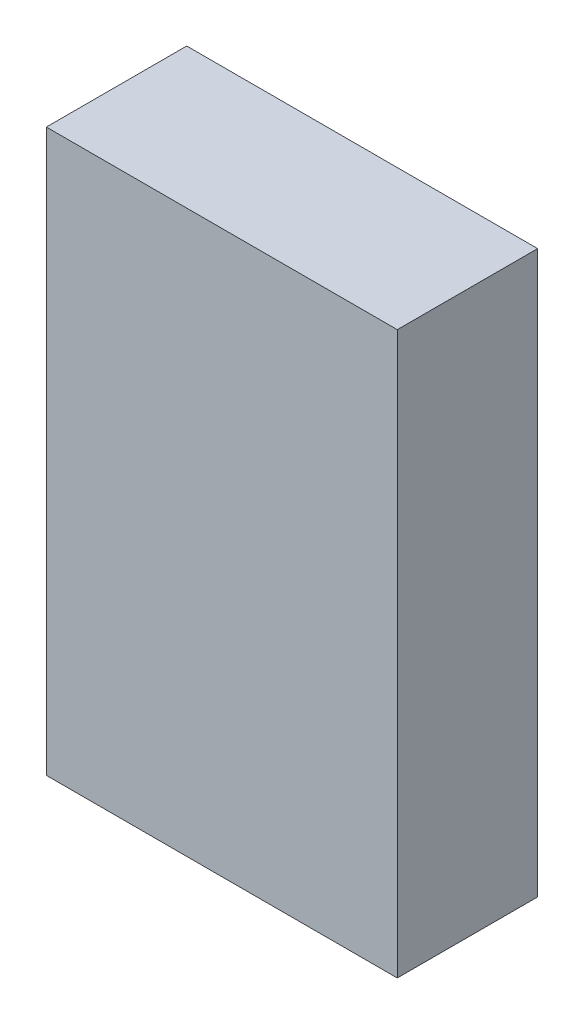
ISO-10303-21;
HEADER;
FILE_DESCRIPTION(('STEP AP214'),'2;1');
FILE_NAME('part.step','',(''),(''),'','','');
FILE_SCHEMA(('AUTOMOTIVE_DESIGN { 1 0 10303 214 1 1 1 1 }'));
ENDSEC;
DATA;
#1=APPLICATION_CONTEXT('core data for automotive mechanical design processes');
#2=APPLICATION_PROTOCOL_DEFINITION('international standard','automotive_design',2000,#1);
#3=PRODUCT_CONTEXT('',#1,'mechanical');
#4=PRODUCT('Part','Part','',(#3));
#5=PRODUCT_RELATED_PRODUCT_CATEGORY('part','',(#4));
#6=PRODUCT_DEFINITION_FORMATION('','',#4);
#7=PRODUCT_DEFINITION_CONTEXT('part definition',#1,'design');
#8=PRODUCT_DEFINITION('design','',#6,#7);
#9=PRODUCT_DEFINITION_SHAPE('','',#8);
#10=(LENGTH_UNIT() NAMED_UNIT(*) SI_UNIT(.MILLI.,.METRE.));
#11=(NAMED_UNIT(*) PLANE_ANGLE_UNIT() SI_UNIT($,.RADIAN.));
#12=(NAMED_UNIT(*) SI_UNIT($,.STERADIAN.) SOLID_ANGLE_UNIT());
#13=UNCERTAINTY_MEASURE_WITH_UNIT(LENGTH_MEASURE(1.E-05),#10,'distance_accuracy_value','');
#14=(GEOMETRIC_REPRESENTATION_CONTEXT(3) GLOBAL_UNCERTAINTY_ASSIGNED_CONTEXT((#13)) GLOBAL_UNIT_ASSIGNED_CONTEXT((#10,
#11,#12)) REPRESENTATION_CONTEXT('',''));
#15=CARTESIAN_POINT('',(0.,0.,0.));
#16=DIRECTION('',(0.,0.,1.));
#17=DIRECTION('',(1.,0.,0.));
#18=AXIS2_PLACEMENT_3D('',#15,#16,#17);
#19=CARTESIAN_POINT('',(0.,0.,0.499999));
#20=DIRECTION('',(0.,0.,1.));
#21=DIRECTION('',(1.,0.,0.));
#22=AXIS2_PLACEMENT_3D('',#19,#20,#21);
#23=PLANE('',#22);
#24=DIRECTION('',(-1.,0.,0.));
#25=VECTOR('',#24,1.);
#26=CARTESIAN_POINT('',(0.62500002,1.00000054,0.499999));
#27=LINE('',#26,#25);
#28=CARTESIAN_POINT('',(0.62500002,1.00000054,0.499999));
#29=VERTEX_POINT('',#28);
#30=CARTESIAN_POINT('',(-0.62500002,1.00000054,0.499999));
#31=VERTEX_POINT('',#30);
#32=EDGE_CURVE('E90',#29,#31,#27,.T.);
#33=ORIENTED_EDGE('',*,*,#32,.T.);
#34=DIRECTION('',(0.,-1.,0.));
#35=VECTOR('',#34,1.);
#36=CARTESIAN_POINT('',(-0.62500002,1.00000054,0.499999));
#37=LINE('',#36,#35);
#38=CARTESIAN_POINT('',(-0.62500002,-1.00000054,0.499999));
#39=VERTEX_POINT('',#38);
#40=EDGE_CURVE('E88',#31,#39,#37,.T.);
#41=ORIENTED_EDGE('',*,*,#40,.T.);
#42=DIRECTION('',(1.,0.,0.));
#43=VECTOR('',#42,1.);
#44=CARTESIAN_POINT('',(-0.62500002,-1.00000054,0.499999));
#45=LINE('',#44,#43);
#46=CARTESIAN_POINT('',(0.62500002,-1.00000054,0.499999));
#47=VERTEX_POINT('',#46);
#48=EDGE_CURVE('E81',#39,#47,#45,.T.);
#49=ORIENTED_EDGE('',*,*,#48,.T.);
#50=DIRECTION('',(0.,1.,0.));
#51=VECTOR('',#50,1.);
#52=CARTESIAN_POINT('',(0.62500002,-1.00000054,0.499999));
#53=LINE('',#52,#51);
#54=EDGE_CURVE('E11',#47,#29,#53,.T.);
#55=ORIENTED_EDGE('',*,*,#54,.T.);
#56=EDGE_LOOP('',(#33,#41,#49,#55));
#57=FACE_BOUND('',#56,.T.);
#58=ADVANCED_FACE('F16',(#57),#23,.T.);
#59=CARTESIAN_POINT('',(0.,0.,0.));
#60=DIRECTION('',(0.,0.,1.));
#61=DIRECTION('',(1.,0.,0.));
#62=AXIS2_PLACEMENT_3D('',#59,#60,#61);
#63=PLANE('',#62);
#64=DIRECTION('',(0.,1.,0.));
#65=VECTOR('',#64,1.);
#66=CARTESIAN_POINT('',(0.62500002,-1.00000054,0.));
#67=LINE('',#66,#65);
#68=CARTESIAN_POINT('',(0.62500002,-1.00000054,0.));
#69=VERTEX_POINT('',#68);
#70=CARTESIAN_POINT('',(0.62500002,1.00000054,0.));
#71=VERTEX_POINT('',#70);
#72=EDGE_CURVE('E27',#69,#71,#67,.T.);
#73=ORIENTED_EDGE('',*,*,#72,.F.);
#74=DIRECTION('',(1.,0.,0.));
#75=VECTOR('',#74,1.);
#76=CARTESIAN_POINT('',(-0.62500002,-1.00000054,0.));
#77=LINE('',#76,#75);
#78=CARTESIAN_POINT('',(-0.62500002,-1.00000054,0.));
#79=VERTEX_POINT('',#78);
#80=EDGE_CURVE('E20',#79,#69,#77,.T.);
#81=ORIENTED_EDGE('',*,*,#80,.F.);
#82=DIRECTION('',(0.,-1.,0.));
#83=VECTOR('',#82,1.);
#84=CARTESIAN_POINT('',(-0.62500002,1.00000054,0.));
#85=LINE('',#84,#83);
#86=CARTESIAN_POINT('',(-0.62500002,1.00000054,0.));
#87=VERTEX_POINT('',#86);
#88=EDGE_CURVE('E57',#87,#79,#85,.T.);
#89=ORIENTED_EDGE('',*,*,#88,.F.);
#90=DIRECTION('',(-1.,0.,0.));
#91=VECTOR('',#90,1.);
#92=CARTESIAN_POINT('',(0.62500002,1.00000054,0.));
#93=LINE('',#92,#91);
#94=EDGE_CURVE('E112',#71,#87,#93,.T.);
#95=ORIENTED_EDGE('',*,*,#94,.F.);
#96=EDGE_LOOP('',(#73,#81,#89,#95));
#97=FACE_BOUND('',#96,.T.);
#98=ADVANCED_FACE('F122',(#97),#63,.F.);
#99=CARTESIAN_POINT('',(0.62500002,-1.00000054,0.));
#100=DIRECTION('',(-1.,0.,0.));
#101=DIRECTION('',(0.,0.,1.));
#102=AXIS2_PLACEMENT_3D('',#99,#100,#101);
#103=PLANE('',#102);
#104=ORIENTED_EDGE('',*,*,#72,.T.);
#105=DIRECTION('',(0.,0.,1.));
#106=VECTOR('',#105,1.);
#107=CARTESIAN_POINT('',(0.62500002,1.00000054,0.));
#108=LINE('',#107,#106);
#109=EDGE_CURVE('E101',#71,#29,#108,.T.);
#110=ORIENTED_EDGE('',*,*,#109,.T.);
#111=ORIENTED_EDGE('',*,*,#54,.F.);
#112=DIRECTION('',(0.,0.,1.));
#113=VECTOR('',#112,1.);
#114=CARTESIAN_POINT('',(0.62500002,-1.00000054,0.));
#115=LINE('',#114,#113);
#116=EDGE_CURVE('E86',#69,#47,#115,.T.);
#117=ORIENTED_EDGE('',*,*,#116,.F.);
#118=EDGE_LOOP('',(#104,#110,#111,#117));
#119=FACE_BOUND('',#118,.T.);
#120=ADVANCED_FACE('F123',(#119),#103,.F.);
#121=CARTESIAN_POINT('',(-0.62500002,-1.00000054,0.));
#122=DIRECTION('',(0.,1.,0.));
#123=DIRECTION('',(1.,0.,0.));
#124=AXIS2_PLACEMENT_3D('',#121,#122,#123);
#125=PLANE('',#124);
#126=ORIENTED_EDGE('',*,*,#80,.T.);
#127=ORIENTED_EDGE('',*,*,#116,.T.);
#128=ORIENTED_EDGE('',*,*,#48,.F.);
#129=DIRECTION('',(0.,0.,1.));
#130=VECTOR('',#129,1.);
#131=CARTESIAN_POINT('',(-0.62500002,-1.00000054,0.));
#132=LINE('',#131,#130);
#133=EDGE_CURVE('E85',#79,#39,#132,.T.);
#134=ORIENTED_EDGE('',*,*,#133,.F.);
#135=EDGE_LOOP('',(#126,#127,#128,#134));
#136=FACE_BOUND('',#135,.T.);
#137=ADVANCED_FACE('F83',(#136),#125,.F.);
#138=CARTESIAN_POINT('',(-0.62500002,1.00000054,0.));
#139=DIRECTION('',(1.,0.,0.));
#140=DIRECTION('',(0.,1.,0.));
#141=AXIS2_PLACEMENT_3D('',#138,#139,#140);
#142=PLANE('',#141);
#143=ORIENTED_EDGE('',*,*,#88,.T.);
#144=ORIENTED_EDGE('',*,*,#133,.T.);
#145=ORIENTED_EDGE('',*,*,#40,.F.);
#146=DIRECTION('',(0.,0.,1.));
#147=VECTOR('',#146,1.);
#148=CARTESIAN_POINT('',(-0.62500002,1.00000054,0.));
#149=LINE('',#148,#147);
#150=EDGE_CURVE('E105',#87,#31,#149,.T.);
#151=ORIENTED_EDGE('',*,*,#150,.F.);
#152=EDGE_LOOP('',(#143,#144,#145,#151));
#153=FACE_BOUND('',#152,.T.);
#154=ADVANCED_FACE('F18',(#153),#142,.F.);
#155=CARTESIAN_POINT('',(0.62500002,1.00000054,0.));
#156=DIRECTION('',(0.,-1.,0.));
#157=DIRECTION('',(0.,0.,-1.));
#158=AXIS2_PLACEMENT_3D('',#155,#156,#157);
#159=PLANE('',#158);
#160=ORIENTED_EDGE('',*,*,#94,.T.);
#161=ORIENTED_EDGE('',*,*,#150,.T.);
#162=ORIENTED_EDGE('',*,*,#32,.F.);
#163=ORIENTED_EDGE('',*,*,#109,.F.);
#164=EDGE_LOOP('',(#160,#161,#162,#163));
#165=FACE_BOUND('',#164,.T.);
#166=ADVANCED_FACE('F121',(#165),#159,.F.);
#167=CLOSED_SHELL('',(#58,#98,#120,#137,#154,#166));
#168=MANIFOLD_SOLID_BREP('B1',#167);
#169=ADVANCED_BREP_SHAPE_REPRESENTATION('',(#18,#168),#14);
#170=SHAPE_DEFINITION_REPRESENTATION(#9,#169);
ENDSEC;
END-ISO-10303-21;
